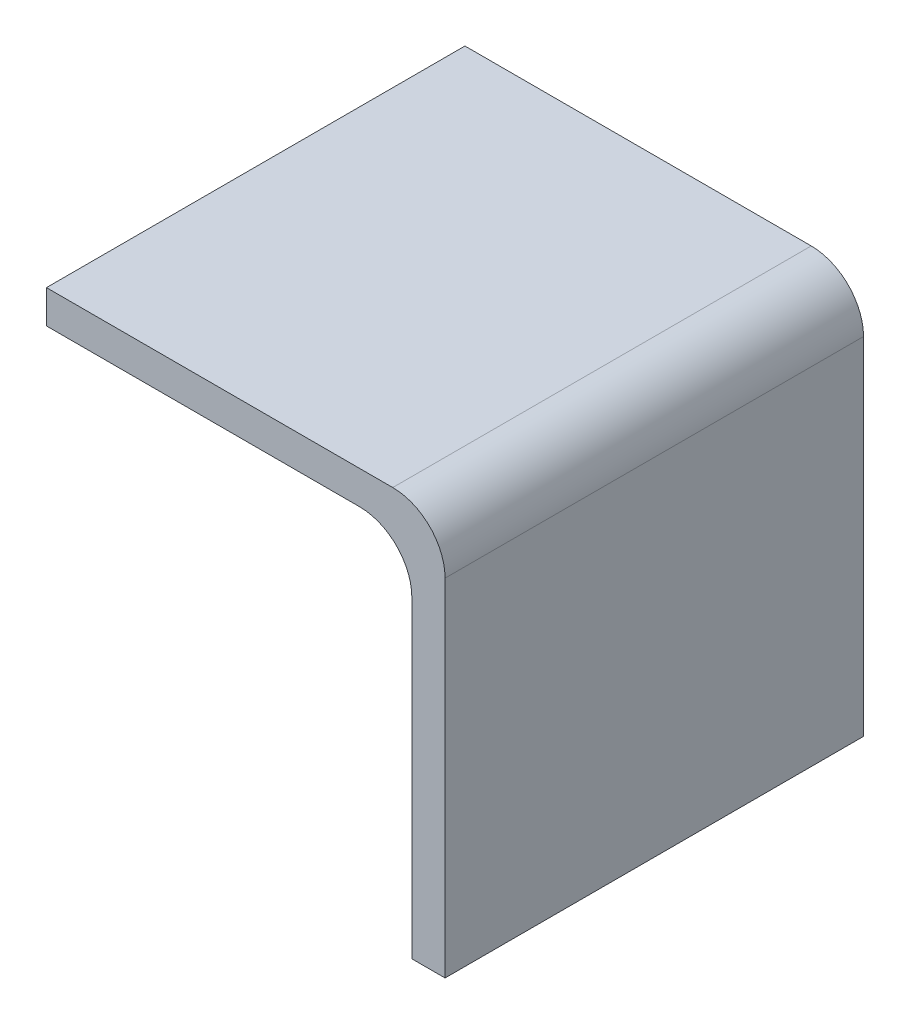
ISO-10303-21;
HEADER;
FILE_DESCRIPTION(('STEP AP214'),'2;1');
FILE_NAME('part.step','',(''),(''),'','','');
FILE_SCHEMA(('AUTOMOTIVE_DESIGN { 1 0 10303 214 1 1 1 1 }'));
ENDSEC;
DATA;
#1=APPLICATION_CONTEXT('core data for automotive mechanical design processes');
#2=APPLICATION_PROTOCOL_DEFINITION('international standard','automotive_design',2000,#1);
#3=PRODUCT_CONTEXT('',#1,'mechanical');
#4=PRODUCT('Part','Part','',(#3));
#5=PRODUCT_RELATED_PRODUCT_CATEGORY('part','',(#4));
#6=PRODUCT_DEFINITION_FORMATION('','',#4);
#7=PRODUCT_DEFINITION_CONTEXT('part definition',#1,'design');
#8=PRODUCT_DEFINITION('design','',#6,#7);
#9=PRODUCT_DEFINITION_SHAPE('','',#8);
#10=(LENGTH_UNIT() NAMED_UNIT(*) SI_UNIT(.MILLI.,.METRE.));
#11=(NAMED_UNIT(*) PLANE_ANGLE_UNIT() SI_UNIT($,.RADIAN.));
#12=(NAMED_UNIT(*) SI_UNIT($,.STERADIAN.) SOLID_ANGLE_UNIT());
#13=UNCERTAINTY_MEASURE_WITH_UNIT(LENGTH_MEASURE(1.E-05),#10,'distance_accuracy_value','');
#14=(GEOMETRIC_REPRESENTATION_CONTEXT(3) GLOBAL_UNCERTAINTY_ASSIGNED_CONTEXT((#13)) GLOBAL_UNIT_ASSIGNED_CONTEXT((#10,
#11,#12)) REPRESENTATION_CONTEXT('',''));
#15=CARTESIAN_POINT('',(0.,0.,0.));
#16=DIRECTION('',(0.,0.,1.));
#17=DIRECTION('',(1.,0.,0.));
#18=AXIS2_PLACEMENT_3D('',#15,#16,#17);
#19=CARTESIAN_POINT('',(0.,0.,40.));
#20=DIRECTION('',(1.,0.,0.));
#21=DIRECTION('',(0.,0.,-1.));
#22=AXIS2_PLACEMENT_3D('',#19,#20,#21);
#23=PLANE('',#22);
#24=DIRECTION('',(0.,-1.,0.));
#25=VECTOR('',#24,1.);
#26=CARTESIAN_POINT('',(0.,0.,0.));
#27=LINE('',#26,#25);
#28=CARTESIAN_POINT('',(0.,3.175,0.));
#29=VERTEX_POINT('',#28);
#30=CARTESIAN_POINT('',(0.,0.,0.));
#31=VERTEX_POINT('',#30);
#32=EDGE_CURVE('E120',#29,#31,#27,.T.);
#33=ORIENTED_EDGE('',*,*,#32,.T.);
#34=DIRECTION('',(0.,0.,-1.));
#35=VECTOR('',#34,1.);
#36=CARTESIAN_POINT('',(0.,0.,40.));
#37=LINE('',#36,#35);
#38=CARTESIAN_POINT('',(0.,0.,40.));
#39=VERTEX_POINT('',#38);
#40=EDGE_CURVE('E101',#39,#31,#37,.T.);
#41=ORIENTED_EDGE('',*,*,#40,.F.);
#42=DIRECTION('',(0.,-1.,0.));
#43=VECTOR('',#42,1.);
#44=CARTESIAN_POINT('',(0.,0.,40.));
#45=LINE('',#44,#43);
#46=CARTESIAN_POINT('',(0.,3.175,40.));
#47=VERTEX_POINT('',#46);
#48=EDGE_CURVE('E108',#47,#39,#45,.T.);
#49=ORIENTED_EDGE('',*,*,#48,.F.);
#50=DIRECTION('',(0.,0.,-1.));
#51=VECTOR('',#50,1.);
#52=CARTESIAN_POINT('',(0.,3.175,40.));
#53=LINE('',#52,#51);
#54=EDGE_CURVE('E151',#47,#29,#53,.T.);
#55=ORIENTED_EDGE('',*,*,#54,.T.);
#56=EDGE_LOOP('',(#33,#41,#49,#55));
#57=FACE_BOUND('',#56,.T.);
#58=ADVANCED_FACE('F32',(#57),#23,.F.);
#59=CARTESIAN_POINT('',(0.,0.,40.));
#60=DIRECTION('',(0.,1.,0.));
#61=DIRECTION('',(-1.,0.,0.));
#62=AXIS2_PLACEMENT_3D('',#59,#60,#61);
#63=PLANE('',#62);
#64=DIRECTION('',(1.,0.,0.));
#65=VECTOR('',#64,1.);
#66=CARTESIAN_POINT('',(0.,0.,0.));
#67=LINE('',#66,#65);
#68=CARTESIAN_POINT('',(29.925,0.,0.));
#69=VERTEX_POINT('',#68);
#70=EDGE_CURVE('E165',#31,#69,#67,.T.);
#71=ORIENTED_EDGE('',*,*,#70,.T.);
#72=DIRECTION('',(0.,0.,-1.));
#73=VECTOR('',#72,1.);
#74=CARTESIAN_POINT('',(29.925,0.,40.));
#75=LINE('',#74,#73);
#76=CARTESIAN_POINT('',(29.925,0.,40.));
#77=VERTEX_POINT('',#76);
#78=EDGE_CURVE('E104',#69,#77,#75,.F.);
#79=ORIENTED_EDGE('',*,*,#78,.T.);
#80=DIRECTION('',(1.,0.,0.));
#81=VECTOR('',#80,1.);
#82=CARTESIAN_POINT('',(0.,0.,40.));
#83=LINE('',#82,#81);
#84=EDGE_CURVE('E96',#39,#77,#83,.T.);
#85=ORIENTED_EDGE('',*,*,#84,.F.);
#86=ORIENTED_EDGE('',*,*,#40,.T.);
#87=EDGE_LOOP('',(#71,#79,#85,#86));
#88=FACE_BOUND('',#87,.T.);
#89=ADVANCED_FACE('F99',(#88),#63,.F.);
#90=CARTESIAN_POINT('',(34.925,0.,40.));
#91=DIRECTION('',(1.,0.,0.));
#92=DIRECTION('',(0.,1.,0.));
#93=AXIS2_PLACEMENT_3D('',#90,#91,#92);
#94=PLANE('',#93);
#95=DIRECTION('',(0.,-1.,0.));
#96=VECTOR('',#95,1.);
#97=CARTESIAN_POINT('',(34.925,0.,40.));
#98=LINE('',#97,#96);
#99=CARTESIAN_POINT('',(34.925,-5.,40.));
#100=VERTEX_POINT('',#99);
#101=CARTESIAN_POINT('',(34.925,-34.925,40.));
#102=VERTEX_POINT('',#101);
#103=EDGE_CURVE('E107',#100,#102,#98,.T.);
#104=ORIENTED_EDGE('',*,*,#103,.F.);
#105=DIRECTION('',(0.,0.,-1.));
#106=VECTOR('',#105,1.);
#107=CARTESIAN_POINT('',(34.925,-5.,0.));
#108=LINE('',#107,#106);
#109=CARTESIAN_POINT('',(34.925,-5.,0.));
#110=VERTEX_POINT('',#109);
#111=EDGE_CURVE('E121',#100,#110,#108,.T.);
#112=ORIENTED_EDGE('',*,*,#111,.T.);
#113=DIRECTION('',(0.,-1.,0.));
#114=VECTOR('',#113,1.);
#115=CARTESIAN_POINT('',(34.925,0.,0.));
#116=LINE('',#115,#114);
#117=CARTESIAN_POINT('',(34.925,-34.925,0.));
#118=VERTEX_POINT('',#117);
#119=EDGE_CURVE('E164',#110,#118,#116,.T.);
#120=ORIENTED_EDGE('',*,*,#119,.T.);
#121=DIRECTION('',(0.,0.,-1.));
#122=VECTOR('',#121,1.);
#123=CARTESIAN_POINT('',(34.925,-34.925,40.));
#124=LINE('',#123,#122);
#125=EDGE_CURVE('E122',#102,#118,#124,.T.);
#126=ORIENTED_EDGE('',*,*,#125,.F.);
#127=EDGE_LOOP('',(#104,#112,#120,#126));
#128=FACE_BOUND('',#127,.T.);
#129=ADVANCED_FACE('F176',(#128),#94,.F.);
#130=CARTESIAN_POINT('',(38.1,-34.925,40.));
#131=DIRECTION('',(0.,1.,0.));
#132=DIRECTION('',(0.,0.,1.));
#133=AXIS2_PLACEMENT_3D('',#130,#131,#132);
#134=PLANE('',#133);
#135=DIRECTION('',(1.,0.,0.));
#136=VECTOR('',#135,1.);
#137=CARTESIAN_POINT('',(38.1,-34.925,0.));
#138=LINE('',#137,#136);
#139=CARTESIAN_POINT('',(38.1,-34.925,0.));
#140=VERTEX_POINT('',#139);
#141=EDGE_CURVE('E147',#118,#140,#138,.T.);
#142=ORIENTED_EDGE('',*,*,#141,.T.);
#143=DIRECTION('',(0.,0.,-1.));
#144=VECTOR('',#143,1.);
#145=CARTESIAN_POINT('',(38.1,-34.925,40.));
#146=LINE('',#145,#144);
#147=CARTESIAN_POINT('',(38.1,-34.925,40.));
#148=VERTEX_POINT('',#147);
#149=EDGE_CURVE('E127',#148,#140,#146,.T.);
#150=ORIENTED_EDGE('',*,*,#149,.F.);
#151=DIRECTION('',(1.,0.,0.));
#152=VECTOR('',#151,1.);
#153=CARTESIAN_POINT('',(38.1,-34.925,40.));
#154=LINE('',#153,#152);
#155=EDGE_CURVE('E160',#102,#148,#154,.T.);
#156=ORIENTED_EDGE('',*,*,#155,.F.);
#157=ORIENTED_EDGE('',*,*,#125,.T.);
#158=EDGE_LOOP('',(#142,#150,#156,#157));
#159=FACE_BOUND('',#158,.T.);
#160=ADVANCED_FACE('F159',(#159),#134,.F.);
#161=CARTESIAN_POINT('',(38.1,0.,40.));
#162=DIRECTION('',(-1.,0.,0.));
#163=DIRECTION('',(0.,0.,1.));
#164=AXIS2_PLACEMENT_3D('',#161,#162,#163);
#165=PLANE('',#164);
#166=DIRECTION('',(0.,1.,0.));
#167=VECTOR('',#166,1.);
#168=CARTESIAN_POINT('',(38.1,0.,0.));
#169=LINE('',#168,#167);
#170=CARTESIAN_POINT('',(38.1,-1.825,0.));
#171=VERTEX_POINT('',#170);
#172=EDGE_CURVE('E145',#140,#171,#169,.T.);
#173=ORIENTED_EDGE('',*,*,#172,.T.);
#174=DIRECTION('',(0.,0.,-1.));
#175=VECTOR('',#174,1.);
#176=CARTESIAN_POINT('',(38.1,-1.825,40.));
#177=LINE('',#176,#175);
#178=CARTESIAN_POINT('',(38.1,-1.825,40.));
#179=VERTEX_POINT('',#178);
#180=EDGE_CURVE('E40',#171,#179,#177,.F.);
#181=ORIENTED_EDGE('',*,*,#180,.T.);
#182=DIRECTION('',(0.,1.,0.));
#183=VECTOR('',#182,1.);
#184=CARTESIAN_POINT('',(38.1,0.,40.));
#185=LINE('',#184,#183);
#186=EDGE_CURVE('E155',#148,#179,#185,.T.);
#187=ORIENTED_EDGE('',*,*,#186,.F.);
#188=ORIENTED_EDGE('',*,*,#149,.T.);
#189=EDGE_LOOP('',(#173,#181,#187,#188));
#190=FACE_BOUND('',#189,.T.);
#191=ADVANCED_FACE('F154',(#190),#165,.F.);
#192=CARTESIAN_POINT('',(0.,3.175,40.));
#193=DIRECTION('',(0.,-1.,0.));
#194=DIRECTION('',(0.,0.,-1.));
#195=AXIS2_PLACEMENT_3D('',#192,#193,#194);
#196=PLANE('',#195);
#197=DIRECTION('',(-1.,0.,0.));
#198=VECTOR('',#197,1.);
#199=CARTESIAN_POINT('',(0.,3.175,40.));
#200=LINE('',#199,#198);
#201=CARTESIAN_POINT('',(33.1,3.175,40.));
#202=VERTEX_POINT('',#201);
#203=EDGE_CURVE('E113',#202,#47,#200,.T.);
#204=ORIENTED_EDGE('',*,*,#203,.F.);
#205=DIRECTION('',(0.,0.,-1.));
#206=VECTOR('',#205,1.);
#207=CARTESIAN_POINT('',(33.1,3.175,40.));
#208=LINE('',#207,#206);
#209=CARTESIAN_POINT('',(33.1,3.175,0.));
#210=VERTEX_POINT('',#209);
#211=EDGE_CURVE('E136',#202,#210,#208,.T.);
#212=ORIENTED_EDGE('',*,*,#211,.T.);
#213=DIRECTION('',(-1.,0.,0.));
#214=VECTOR('',#213,1.);
#215=CARTESIAN_POINT('',(0.,3.175,0.));
#216=LINE('',#215,#214);
#217=EDGE_CURVE('E117',#210,#29,#216,.T.);
#218=ORIENTED_EDGE('',*,*,#217,.T.);
#219=ORIENTED_EDGE('',*,*,#54,.F.);
#220=EDGE_LOOP('',(#204,#212,#218,#219));
#221=FACE_BOUND('',#220,.T.);
#222=ADVANCED_FACE('F141',(#221),#196,.F.);
#223=CARTESIAN_POINT('',(0.,0.,40.));
#224=DIRECTION('',(0.,0.,-1.));
#225=DIRECTION('',(-1.,0.,0.));
#226=AXIS2_PLACEMENT_3D('',#223,#224,#225);
#227=PLANE('',#226);
#228=ORIENTED_EDGE('',*,*,#186,.T.);
#229=CARTESIAN_POINT('',(33.1,-1.825,40.));
#230=DIRECTION('',(0.,0.,-1.));
#231=DIRECTION('',(-1.,0.,0.));
#232=AXIS2_PLACEMENT_3D('',#229,#230,#231);
#233=CIRCLE('',#232,5.);
#234=EDGE_CURVE('E11',#179,#202,#233,.F.);
#235=ORIENTED_EDGE('',*,*,#234,.T.);
#236=ORIENTED_EDGE('',*,*,#203,.T.);
#237=ORIENTED_EDGE('',*,*,#48,.T.);
#238=ORIENTED_EDGE('',*,*,#84,.T.);
#239=CARTESIAN_POINT('',(29.925,-5.,40.));
#240=DIRECTION('',(0.,0.,-1.));
#241=DIRECTION('',(-1.,0.,0.));
#242=AXIS2_PLACEMENT_3D('',#239,#240,#241);
#243=CIRCLE('',#242,5.);
#244=EDGE_CURVE('E134',#77,#100,#243,.T.);
#245=ORIENTED_EDGE('',*,*,#244,.T.);
#246=ORIENTED_EDGE('',*,*,#103,.T.);
#247=ORIENTED_EDGE('',*,*,#155,.T.);
#248=EDGE_LOOP('',(#228,#235,#236,#237,#238,#245,#246,#247));
#249=FACE_BOUND('',#248,.T.);
#250=ADVANCED_FACE('F111',(#249),#227,.F.);
#251=CARTESIAN_POINT('',(0.,0.,0.));
#252=DIRECTION('',(0.,0.,-1.));
#253=DIRECTION('',(-1.,0.,0.));
#254=AXIS2_PLACEMENT_3D('',#251,#252,#253);
#255=PLANE('',#254);
#256=ORIENTED_EDGE('',*,*,#217,.F.);
#257=CARTESIAN_POINT('',(33.1,-1.825,0.));
#258=DIRECTION('',(0.,0.,-1.));
#259=DIRECTION('',(-1.,0.,0.));
#260=AXIS2_PLACEMENT_3D('',#257,#258,#259);
#261=CIRCLE('',#260,5.);
#262=EDGE_CURVE('E54',#210,#171,#261,.T.);
#263=ORIENTED_EDGE('',*,*,#262,.T.);
#264=ORIENTED_EDGE('',*,*,#172,.F.);
#265=ORIENTED_EDGE('',*,*,#141,.F.);
#266=ORIENTED_EDGE('',*,*,#119,.F.);
#267=CARTESIAN_POINT('',(29.925,-5.,0.));
#268=DIRECTION('',(0.,0.,-1.));
#269=DIRECTION('',(-1.,0.,0.));
#270=AXIS2_PLACEMENT_3D('',#267,#268,#269);
#271=CIRCLE('',#270,5.);
#272=EDGE_CURVE('E132',#110,#69,#271,.F.);
#273=ORIENTED_EDGE('',*,*,#272,.T.);
#274=ORIENTED_EDGE('',*,*,#70,.F.);
#275=ORIENTED_EDGE('',*,*,#32,.F.);
#276=EDGE_LOOP('',(#256,#263,#264,#265,#266,#273,#274,#275));
#277=FACE_BOUND('',#276,.T.);
#278=ADVANCED_FACE('F144',(#277),#255,.T.);
#279=CARTESIAN_POINT('',(29.925,-5.,40.));
#280=DIRECTION('',(0.,0.,1.));
#281=DIRECTION('',(1.,0.,0.));
#282=AXIS2_PLACEMENT_3D('',#279,#280,#281);
#283=CYLINDRICAL_SURFACE('',#282,5.);
#284=ORIENTED_EDGE('',*,*,#244,.F.);
#285=ORIENTED_EDGE('',*,*,#78,.F.);
#286=ORIENTED_EDGE('',*,*,#272,.F.);
#287=ORIENTED_EDGE('',*,*,#111,.F.);
#288=EDGE_LOOP('',(#284,#285,#286,#287));
#289=FACE_BOUND('',#288,.T.);
#290=ADVANCED_FACE('F178',(#289),#283,.F.);
#291=CARTESIAN_POINT('',(33.1,-1.825,40.));
#292=DIRECTION('',(0.,0.,-1.));
#293=DIRECTION('',(-1.,0.,0.));
#294=AXIS2_PLACEMENT_3D('',#291,#292,#293);
#295=CYLINDRICAL_SURFACE('',#294,5.);
#296=ORIENTED_EDGE('',*,*,#234,.F.);
#297=ORIENTED_EDGE('',*,*,#180,.F.);
#298=ORIENTED_EDGE('',*,*,#262,.F.);
#299=ORIENTED_EDGE('',*,*,#211,.F.);
#300=EDGE_LOOP('',(#296,#297,#298,#299));
#301=FACE_BOUND('',#300,.T.);
#302=ADVANCED_FACE('F34',(#301),#295,.T.);
#303=CLOSED_SHELL('',(#58,#89,#129,#160,#191,#222,#250,#278,#290,#302));
#304=MANIFOLD_SOLID_BREP('B2',#303);
#305=ADVANCED_BREP_SHAPE_REPRESENTATION('',(#18,#304),#14);
#306=SHAPE_DEFINITION_REPRESENTATION(#9,#305);
ENDSEC;
END-ISO-10303-21;
